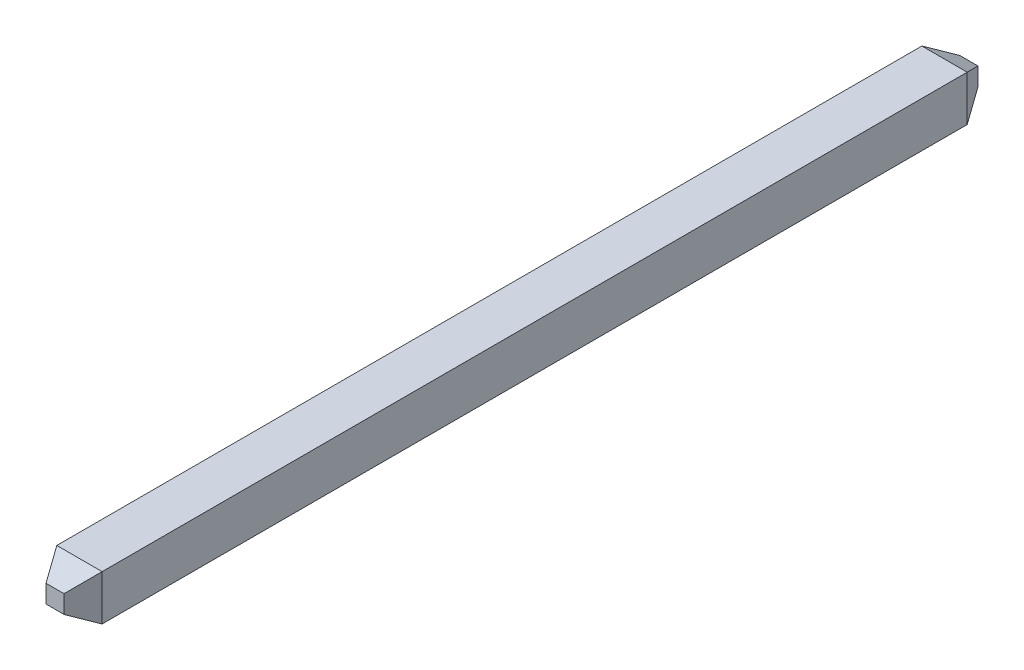
ISO-10303-21;
HEADER;
FILE_DESCRIPTION(('STEP AP214'),'2;1');
FILE_NAME('part.step','',(''),(''),'','','');
FILE_SCHEMA(('AUTOMOTIVE_DESIGN { 1 0 10303 214 1 1 1 1 }'));
ENDSEC;
DATA;
#1=APPLICATION_CONTEXT('core data for automotive mechanical design processes');
#2=APPLICATION_PROTOCOL_DEFINITION('international standard','automotive_design',2000,#1);
#3=PRODUCT_CONTEXT('',#1,'mechanical');
#4=PRODUCT('Part','Part','',(#3));
#5=PRODUCT_RELATED_PRODUCT_CATEGORY('part','',(#4));
#6=PRODUCT_DEFINITION_FORMATION('','',#4);
#7=PRODUCT_DEFINITION_CONTEXT('part definition',#1,'design');
#8=PRODUCT_DEFINITION('design','',#6,#7);
#9=PRODUCT_DEFINITION_SHAPE('','',#8);
#10=(LENGTH_UNIT() NAMED_UNIT(*) SI_UNIT(.MILLI.,.METRE.));
#11=(NAMED_UNIT(*) PLANE_ANGLE_UNIT() SI_UNIT($,.RADIAN.));
#12=(NAMED_UNIT(*) SI_UNIT($,.STERADIAN.) SOLID_ANGLE_UNIT());
#13=UNCERTAINTY_MEASURE_WITH_UNIT(LENGTH_MEASURE(1.E-05),#10,'distance_accuracy_value','');
#14=(GEOMETRIC_REPRESENTATION_CONTEXT(3) GLOBAL_UNCERTAINTY_ASSIGNED_CONTEXT((#13)) GLOBAL_UNIT_ASSIGNED_CONTEXT((#10,
#11,#12)) REPRESENTATION_CONTEXT('',''));
#15=CARTESIAN_POINT('',(0.,0.,0.));
#16=DIRECTION('',(0.,0.,1.));
#17=DIRECTION('',(1.,0.,0.));
#18=AXIS2_PLACEMENT_3D('',#15,#16,#17);
#19=CARTESIAN_POINT('',(5.20011510041924,-1.595,-3.20872569516347));
#20=DIRECTION('',(0.872569516347453,0.,-0.488489958076081));
#21=DIRECTION('',(-0.488489958076081,0.,-0.872569516347453));
#22=AXIS2_PLACEMENT_3D('',#19,#20,#21);
#23=PLANE('',#22);
#24=DIRECTION('',(0.,1.,0.));
#25=VECTOR('',#24,1.);
#26=CARTESIAN_POINT('',(5.39534185664468,-1.595,-2.86000017186176));
#27=LINE('',#26,#25);
#28=CARTESIAN_POINT('',(5.39534185663263,-1.58500002468493,-2.85999984563027));
#29=VERTEX_POINT('',#28);
#30=CARTESIAN_POINT('',(5.39534201729187,-0.954999839641339,-2.8599998849043));
#31=VERTEX_POINT('',#30);
#32=EDGE_CURVE('E134',#29,#31,#27,.T.);
#33=ORIENTED_EDGE('',*,*,#32,.F.);
#34=DIRECTION('',(0.43907261756865,-0.438284036988111,0.784297353956278));
#35=VECTOR('',#34,1.);
#36=CARTESIAN_POINT('',(5.205,-1.395,-3.2));
#37=LINE('',#36,#35);
#38=CARTESIAN_POINT('',(5.205,-1.395,-3.2));
#39=VERTEX_POINT('',#38);
#40=EDGE_CURVE('E131',#39,#29,#37,.T.);
#41=ORIENTED_EDGE('',*,*,#40,.F.);
#42=DIRECTION('',(0.,1.,0.));
#43=VECTOR('',#42,1.);
#44=CARTESIAN_POINT('',(5.205,-1.405,-3.2));
#45=LINE('',#44,#43);
#46=CARTESIAN_POINT('',(5.205,-1.145,-3.2));
#47=VERTEX_POINT('',#46);
#48=EDGE_CURVE('E90',#47,#39,#45,.F.);
#49=ORIENTED_EDGE('',*,*,#48,.F.);
#50=DIRECTION('',(-0.439072617568649,-0.43828403698811,-0.784297353956278));
#51=VECTOR('',#50,1.);
#52=CARTESIAN_POINT('',(5.39534185664468,-0.955000000000001,-2.86000017186176));
#53=LINE('',#52,#51);
#54=EDGE_CURVE('E123',#31,#47,#53,.T.);
#55=ORIENTED_EDGE('',*,*,#54,.F.);
#56=EDGE_LOOP('',(#33,#41,#49,#55));
#57=FACE_BOUND('',#56,.T.);
#58=ADVANCED_FACE('F16',(#57),#23,.T.);
#59=CARTESIAN_POINT('',(5.20036702814295,-1.595,9.50441734607014));
#60=DIRECTION('',(0.873317045523297,0.,0.487152273933377));
#61=DIRECTION('',(0.487152273933377,0.,-0.873317045523297));
#62=AXIS2_PLACEMENT_3D('',#59,#60,#61);
#63=PLANE('',#62);
#64=DIRECTION('',(-0.437799852400894,0.438586917260846,0.784839349959839));
#65=VECTOR('',#64,1.);
#66=CARTESIAN_POINT('',(5.39489789955164,-1.58500031317147,9.15568378706484));
#67=LINE('',#66,#65);
#68=CARTESIAN_POINT('',(5.39489765454992,-1.58500010892315,9.15568368845103));
#69=VERTEX_POINT('',#68);
#70=CARTESIAN_POINT('',(5.20523855088228,-1.395,9.49568417561491));
#71=VERTEX_POINT('',#70);
#72=EDGE_CURVE('E139',#69,#71,#67,.T.);
#73=ORIENTED_EDGE('',*,*,#72,.F.);
#74=DIRECTION('',(0.,1.,0.));
#75=VECTOR('',#74,1.);
#76=CARTESIAN_POINT('',(5.39489853900642,-1.595,9.155683722437));
#77=LINE('',#76,#75);
#78=CARTESIAN_POINT('',(5.39489765280461,-0.954999822967399,9.15568371270386));
#79=VERTEX_POINT('',#78);
#80=EDGE_CURVE('E100',#79,#69,#77,.F.);
#81=ORIENTED_EDGE('',*,*,#80,.F.);
#82=DIRECTION('',(0.437799852400902,0.438586917260844,-0.784839349959836));
#83=VECTOR('',#82,1.);
#84=CARTESIAN_POINT('',(5.20523855088228,-1.145,9.49568417561491));
#85=LINE('',#84,#83);
#86=CARTESIAN_POINT('',(5.20523855088228,-1.145,9.49568417561491));
#87=VERTEX_POINT('',#86);
#88=EDGE_CURVE('E95',#87,#79,#85,.T.);
#89=ORIENTED_EDGE('',*,*,#88,.F.);
#90=DIRECTION('',(0.,1.,0.));
#91=VECTOR('',#90,1.);
#92=CARTESIAN_POINT('',(5.20523855088228,-1.135,9.49568417561491));
#93=LINE('',#92,#91);
#94=EDGE_CURVE('E19',#71,#87,#93,.T.);
#95=ORIENTED_EDGE('',*,*,#94,.F.);
#96=EDGE_LOOP('',(#73,#81,#89,#95));
#97=FACE_BOUND('',#96,.T.);
#98=ADVANCED_FACE('F97',(#97),#63,.T.);
#99=CARTESIAN_POINT('',(4.94523855088228,-1.135,9.49568417561491));
#100=DIRECTION('',(0.,0.,1.));
#101=DIRECTION('',(1.,0.,0.));
#102=AXIS2_PLACEMENT_3D('',#99,#100,#101);
#103=PLANE('',#102);
#104=DIRECTION('',(1.,0.,0.));
#105=VECTOR('',#104,1.);
#106=CARTESIAN_POINT('',(4.7548966942376,-1.145,9.49568417561491));
#107=LINE('',#106,#105);
#108=CARTESIAN_POINT('',(4.95523855088228,-1.145,9.49568417561491));
#109=VERTEX_POINT('',#108);
#110=EDGE_CURVE('E104',#109,#87,#107,.T.);
#111=ORIENTED_EDGE('',*,*,#110,.F.);
#112=DIRECTION('',(0.,1.,0.));
#113=VECTOR('',#112,1.);
#114=CARTESIAN_POINT('',(4.95523855088228,-1.595,9.49568417561491));
#115=LINE('',#114,#113);
#116=CARTESIAN_POINT('',(4.95523855088228,-1.395,9.49568417561491));
#117=VERTEX_POINT('',#116);
#118=EDGE_CURVE('E148',#117,#109,#115,.T.);
#119=ORIENTED_EDGE('',*,*,#118,.F.);
#120=DIRECTION('',(1.,0.,0.));
#121=VECTOR('',#120,1.);
#122=CARTESIAN_POINT('',(4.7548966942376,-1.395,9.49568417561491));
#123=LINE('',#122,#121);
#124=EDGE_CURVE('E109',#71,#117,#123,.F.);
#125=ORIENTED_EDGE('',*,*,#124,.F.);
#126=ORIENTED_EDGE('',*,*,#94,.T.);
#127=EDGE_LOOP('',(#111,#119,#125,#126));
#128=FACE_BOUND('',#127,.T.);
#129=ADVANCED_FACE('F106',(#128),#103,.T.);
#130=CARTESIAN_POINT('',(4.7548966942376,-1.14987821545568,9.50441360938624));
#131=DIRECTION('',(0.,0.872943377132664,0.487821545567864));
#132=DIRECTION('',(0.,-0.487821545567864,0.872943377132664));
#133=AXIS2_PLACEMENT_3D('',#130,#131,#132);
#134=PLANE('',#133);
#135=DIRECTION('',(-0.439072459537934,0.438284700441648,-0.784297071672516));
#136=VECTOR('',#135,1.);
#137=CARTESIAN_POINT('',(4.95523855088228,-1.145,9.49568417561491));
#138=LINE('',#137,#136);
#139=CARTESIAN_POINT('',(4.7648975037028,-0.954999917527427,9.15568447138296));
#140=VERTEX_POINT('',#139);
#141=EDGE_CURVE('E113',#109,#140,#138,.T.);
#142=ORIENTED_EDGE('',*,*,#141,.F.);
#143=ORIENTED_EDGE('',*,*,#110,.T.);
#144=ORIENTED_EDGE('',*,*,#88,.T.);
#145=DIRECTION('',(1.,0.,0.));
#146=VECTOR('',#145,1.);
#147=CARTESIAN_POINT('',(5.08006658937282,-0.955,9.15568497320463));
#148=LINE('',#147,#146);
#149=EDGE_CURVE('E150',#140,#79,#148,.T.);
#150=ORIENTED_EDGE('',*,*,#149,.F.);
#151=EDGE_LOOP('',(#142,#143,#144,#150));
#152=FACE_BOUND('',#151,.T.);
#153=ADVANCED_FACE('F111',(#152),#134,.T.);
#154=CARTESIAN_POINT('',(4.945,-1.405,-3.2));
#155=DIRECTION('',(0.,0.,-1.));
#156=DIRECTION('',(-1.,0.,0.));
#157=AXIS2_PLACEMENT_3D('',#154,#155,#156);
#158=PLANE('',#157);
#159=ORIENTED_EDGE('',*,*,#48,.T.);
#160=DIRECTION('',(1.,0.,0.));
#161=VECTOR('',#160,1.);
#162=CARTESIAN_POINT('',(4.75534185664468,-1.395,-3.2));
#163=LINE('',#162,#161);
#164=CARTESIAN_POINT('',(4.955,-1.395,-3.2));
#165=VERTEX_POINT('',#164);
#166=EDGE_CURVE('E127',#165,#39,#163,.T.);
#167=ORIENTED_EDGE('',*,*,#166,.F.);
#168=DIRECTION('',(0.,1.,0.));
#169=VECTOR('',#168,1.);
#170=CARTESIAN_POINT('',(4.955,-1.595,-3.2));
#171=LINE('',#170,#169);
#172=CARTESIAN_POINT('',(4.955,-1.145,-3.2));
#173=VERTEX_POINT('',#172);
#174=EDGE_CURVE('E161',#173,#165,#171,.F.);
#175=ORIENTED_EDGE('',*,*,#174,.F.);
#176=DIRECTION('',(1.,0.,0.));
#177=VECTOR('',#176,1.);
#178=CARTESIAN_POINT('',(4.75534185664468,-1.145,-3.2));
#179=LINE('',#178,#177);
#180=EDGE_CURVE('E117',#47,#173,#179,.F.);
#181=ORIENTED_EDGE('',*,*,#180,.F.);
#182=EDGE_LOOP('',(#159,#167,#175,#181));
#183=FACE_BOUND('',#182,.T.);
#184=ADVANCED_FACE('F214',(#183),#158,.T.);
#185=CARTESIAN_POINT('',(4.75534185664468,-0.950121784544321,-2.85127073809043));
#186=DIRECTION('',(0.,0.872943377132663,-0.487821545567865));
#187=DIRECTION('',(0.,0.487821545567865,0.872943377132663));
#188=AXIS2_PLACEMENT_3D('',#185,#186,#187);
#189=PLANE('',#188);
#190=DIRECTION('',(1.,0.,0.));
#191=VECTOR('',#190,1.);
#192=CARTESIAN_POINT('',(5.08006658937282,-0.955,-2.86000017186176));
#193=LINE('',#192,#191);
#194=CARTESIAN_POINT('',(4.76534144768619,-0.954999293190895,-2.8599984305592));
#195=VERTEX_POINT('',#194);
#196=EDGE_CURVE('E157',#31,#195,#193,.F.);
#197=ORIENTED_EDGE('',*,*,#196,.F.);
#198=ORIENTED_EDGE('',*,*,#54,.T.);
#199=ORIENTED_EDGE('',*,*,#180,.T.);
#200=DIRECTION('',(0.437798396819592,-0.438586429089664,-0.784840434713052));
#201=VECTOR('',#200,1.);
#202=CARTESIAN_POINT('',(4.76534066407532,-0.954999279369218,-2.85999803394471));
#203=LINE('',#202,#201);
#204=EDGE_CURVE('E168',#195,#173,#203,.T.);
#205=ORIENTED_EDGE('',*,*,#204,.F.);
#206=EDGE_LOOP('',(#197,#198,#199,#205));
#207=FACE_BOUND('',#206,.T.);
#208=ADVANCED_FACE('F212',(#207),#189,.T.);
#209=CARTESIAN_POINT('',(4.75534185664468,-1.39012178454432,-3.20872943377133));
#210=DIRECTION('',(0.,-0.872943377132663,-0.487821545567865));
#211=DIRECTION('',(0.,0.487821545567865,-0.872943377132663));
#212=AXIS2_PLACEMENT_3D('',#209,#210,#211);
#213=PLANE('',#212);
#214=ORIENTED_EDGE('',*,*,#166,.T.);
#215=ORIENTED_EDGE('',*,*,#40,.T.);
#216=DIRECTION('',(1.,0.,0.));
#217=VECTOR('',#216,1.);
#218=CARTESIAN_POINT('',(4.75494834685547,-1.585,-2.85999756200982));
#219=LINE('',#218,#217);
#220=CARTESIAN_POINT('',(4.76534198218488,-1.58500027023654,-2.85999898491791));
#221=VERTEX_POINT('',#220);
#222=EDGE_CURVE('E39',#221,#29,#219,.T.);
#223=ORIENTED_EDGE('',*,*,#222,.F.);
#224=DIRECTION('',(-0.437798396819593,-0.438586429089661,0.784840434713054));
#225=VECTOR('',#224,1.);
#226=CARTESIAN_POINT('',(4.955,-1.395,-3.2));
#227=LINE('',#226,#225);
#228=EDGE_CURVE('E165',#165,#221,#227,.T.);
#229=ORIENTED_EDGE('',*,*,#228,.F.);
#230=EDGE_LOOP('',(#214,#215,#223,#229));
#231=FACE_BOUND('',#230,.T.);
#232=ADVANCED_FACE('F215',(#231),#213,.T.);
#233=CARTESIAN_POINT('',(5.39534630826875,-1.595,-2.98065701705514));
#234=DIRECTION('',(0.999999999319383,0.,3.68949151672057E-05));
#235=DIRECTION('',(3.68949151672057E-05,0.,-0.999999999319383));
#236=AXIS2_PLACEMENT_3D('',#233,#234,#235);
#237=PLANE('',#236);
#238=DIRECTION('',(3.69481335098094E-05,0.,-0.999999999317418));
#239=VECTOR('',#238,1.);
#240=CARTESIAN_POINT('',(5.39489789955164,-0.955,9.1556837224134));
#241=LINE('',#240,#239);
#242=EDGE_CURVE('E153',#79,#31,#241,.T.);
#243=ORIENTED_EDGE('',*,*,#242,.F.);
#244=ORIENTED_EDGE('',*,*,#80,.T.);
#245=DIRECTION('',(-3.69481335098094E-05,0.,0.999999999317418));
#246=VECTOR('',#245,1.);
#247=CARTESIAN_POINT('',(5.39534185664468,-1.585,-2.86000017186176));
#248=LINE('',#247,#246);
#249=EDGE_CURVE('E174',#29,#69,#248,.T.);
#250=ORIENTED_EDGE('',*,*,#249,.F.);
#251=ORIENTED_EDGE('',*,*,#32,.T.);
#252=EDGE_LOOP('',(#243,#244,#250,#251));
#253=FACE_BOUND('',#252,.T.);
#254=ADVANCED_FACE('F217',(#253),#237,.T.);
#255=CARTESIAN_POINT('',(4.7548966942376,-1.58987821545568,9.14695491370534));
#256=DIRECTION('',(0.,-0.872943377132664,0.487821545567864));
#257=DIRECTION('',(0.,-0.487821545567864,-0.872943377132664));
#258=AXIS2_PLACEMENT_3D('',#255,#256,#257);
#259=PLANE('',#258);
#260=ORIENTED_EDGE('',*,*,#124,.T.);
#261=DIRECTION('',(0.439072459537933,0.438284700441648,0.784297071672517));
#262=VECTOR('',#261,1.);
#263=CARTESIAN_POINT('',(4.76489724886554,-1.5849998023649,9.15568533818575));
#264=LINE('',#263,#262);
#265=CARTESIAN_POINT('',(4.76489781760237,-1.58499988392429,9.15568487573228));
#266=VERTEX_POINT('',#265);
#267=EDGE_CURVE('E144',#266,#117,#264,.T.);
#268=ORIENTED_EDGE('',*,*,#267,.F.);
#269=DIRECTION('',(1.,0.,0.));
#270=VECTOR('',#269,1.);
#271=CARTESIAN_POINT('',(4.75494834685547,-1.585,9.15568372241339));
#272=LINE('',#271,#270);
#273=EDGE_CURVE('E178',#69,#266,#272,.F.);
#274=ORIENTED_EDGE('',*,*,#273,.F.);
#275=ORIENTED_EDGE('',*,*,#72,.T.);
#276=EDGE_LOOP('',(#260,#268,#274,#275));
#277=FACE_BOUND('',#276,.T.);
#278=ADVANCED_FACE('F204',(#277),#259,.T.);
#279=CARTESIAN_POINT('',(4.96012345046304,-1.595,9.50440987077839));
#280=DIRECTION('',(-0.872569516347453,0.,0.488489958076081));
#281=DIRECTION('',(0.488489958076081,0.,0.872569516347453));
#282=AXIS2_PLACEMENT_3D('',#279,#280,#281);
#283=PLANE('',#282);
#284=ORIENTED_EDGE('',*,*,#267,.T.);
#285=ORIENTED_EDGE('',*,*,#118,.T.);
#286=ORIENTED_EDGE('',*,*,#141,.T.);
#287=DIRECTION('',(0.,1.,0.));
#288=VECTOR('',#287,1.);
#289=CARTESIAN_POINT('',(4.76489853896028,-1.595,9.15568497322818));
#290=LINE('',#289,#288);
#291=EDGE_CURVE('E181',#266,#140,#290,.T.);
#292=ORIENTED_EDGE('',*,*,#291,.F.);
#293=EDGE_LOOP('',(#284,#285,#286,#292));
#294=FACE_BOUND('',#293,.T.);
#295=ADVANCED_FACE('F207',(#294),#283,.T.);
#296=CARTESIAN_POINT('',(5.08006658937282,-0.955,9.32634470275115));
#297=DIRECTION('',(0.,1.,0.));
#298=DIRECTION('',(0.,0.,1.));
#299=AXIS2_PLACEMENT_3D('',#296,#297,#298);
#300=PLANE('',#299);
#301=ORIENTED_EDGE('',*,*,#196,.T.);
#302=DIRECTION('',(-3.68949151674615E-05,0.,0.999999999319383));
#303=VECTOR('',#302,1.);
#304=CARTESIAN_POINT('',(4.76489224235438,-0.955000197635096,9.32634821671993));
#305=LINE('',#304,#303);
#306=EDGE_CURVE('E185',#140,#195,#305,.F.);
#307=ORIENTED_EDGE('',*,*,#306,.F.);
#308=ORIENTED_EDGE('',*,*,#149,.T.);
#309=ORIENTED_EDGE('',*,*,#242,.T.);
#310=EDGE_LOOP('',(#301,#307,#308,#309));
#311=FACE_BOUND('',#310,.T.);
#312=ADVANCED_FACE('F209',(#311),#300,.T.);
#313=CARTESIAN_POINT('',(4.95987152273933,-1.595,-3.20873317045523));
#314=DIRECTION('',(-0.873317045523297,0.,-0.487152273933377));
#315=DIRECTION('',(-0.487152273933377,0.,0.873317045523297));
#316=AXIS2_PLACEMENT_3D('',#313,#314,#315);
#317=PLANE('',#316);
#318=DIRECTION('',(0.,1.,0.));
#319=VECTOR('',#318,1.);
#320=CARTESIAN_POINT('',(4.76534185654839,-1.595,-2.85999756199704));
#321=LINE('',#320,#319);
#322=EDGE_CURVE('E26',#195,#221,#321,.F.);
#323=ORIENTED_EDGE('',*,*,#322,.F.);
#324=ORIENTED_EDGE('',*,*,#204,.T.);
#325=ORIENTED_EDGE('',*,*,#174,.T.);
#326=ORIENTED_EDGE('',*,*,#228,.T.);
#327=EDGE_LOOP('',(#323,#324,#325,#326));
#328=FACE_BOUND('',#327,.T.);
#329=ADVANCED_FACE('F198',(#328),#317,.T.);
#330=CARTESIAN_POINT('',(4.75494834685547,-1.585,3.17284922525592));
#331=DIRECTION('',(0.,-1.,0.));
#332=DIRECTION('',(0.,0.,-1.));
#333=AXIS2_PLACEMENT_3D('',#330,#331,#332);
#334=PLANE('',#333);
#335=ORIENTED_EDGE('',*,*,#249,.T.);
#336=ORIENTED_EDGE('',*,*,#273,.T.);
#337=DIRECTION('',(-3.68949151674615E-05,0.,0.999999999319383));
#338=VECTOR('',#337,1.);
#339=CARTESIAN_POINT('',(4.76489224235438,-1.58500072063078,9.32634821671993));
#340=LINE('',#339,#338);
#341=EDGE_CURVE('E11',#221,#266,#340,.T.);
#342=ORIENTED_EDGE('',*,*,#341,.F.);
#343=ORIENTED_EDGE('',*,*,#222,.T.);
#344=EDGE_LOOP('',(#335,#336,#342,#343));
#345=FACE_BOUND('',#344,.T.);
#346=ADVANCED_FACE('F200',(#345),#334,.T.);
#347=CARTESIAN_POINT('',(4.76489224235438,-1.595,9.32634821671993));
#348=DIRECTION('',(-0.999999999319383,0.,-3.68949151674615E-05));
#349=DIRECTION('',(-3.68949151674615E-05,0.,0.999999999319383));
#350=AXIS2_PLACEMENT_3D('',#347,#348,#349);
#351=PLANE('',#350);
#352=ORIENTED_EDGE('',*,*,#322,.T.);
#353=ORIENTED_EDGE('',*,*,#341,.T.);
#354=ORIENTED_EDGE('',*,*,#291,.T.);
#355=ORIENTED_EDGE('',*,*,#306,.T.);
#356=EDGE_LOOP('',(#352,#353,#354,#355));
#357=FACE_BOUND('',#356,.T.);
#358=ADVANCED_FACE('F194',(#357),#351,.T.);
#359=CLOSED_SHELL('',(#58,#98,#129,#153,#184,#208,#232,#254,#278,#295,#312,#329,#346,#358));
#360=MANIFOLD_SOLID_BREP('B1',#359);
#361=ADVANCED_BREP_SHAPE_REPRESENTATION('',(#18,#360),#14);
#362=SHAPE_DEFINITION_REPRESENTATION(#9,#361);
ENDSEC;
END-ISO-10303-21;
